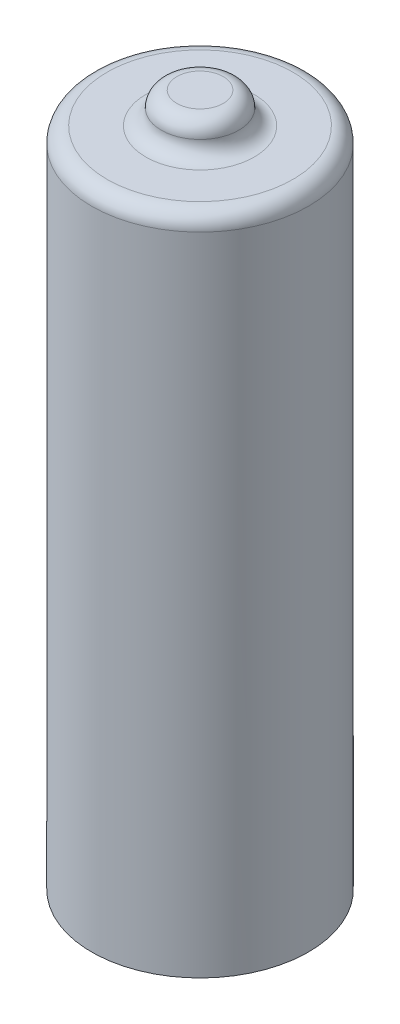
ISO-10303-21;
HEADER;
FILE_DESCRIPTION(('STEP AP214'),'2;1');
FILE_NAME('part.step','',(''),(''),'','','');
FILE_SCHEMA(('AUTOMOTIVE_DESIGN { 1 0 10303 214 1 1 1 1 }'));
ENDSEC;
DATA;
#1=APPLICATION_CONTEXT('core data for automotive mechanical design processes');
#2=APPLICATION_PROTOCOL_DEFINITION('international standard','automotive_design',2000,#1);
#3=PRODUCT_CONTEXT('',#1,'mechanical');
#4=PRODUCT('Part','Part','',(#3));
#5=PRODUCT_RELATED_PRODUCT_CATEGORY('part','',(#4));
#6=PRODUCT_DEFINITION_FORMATION('','',#4);
#7=PRODUCT_DEFINITION_CONTEXT('part definition',#1,'design');
#8=PRODUCT_DEFINITION('design','',#6,#7);
#9=PRODUCT_DEFINITION_SHAPE('','',#8);
#10=(LENGTH_UNIT() NAMED_UNIT(*) SI_UNIT(.MILLI.,.METRE.));
#11=(NAMED_UNIT(*) PLANE_ANGLE_UNIT() SI_UNIT($,.RADIAN.));
#12=(NAMED_UNIT(*) SI_UNIT($,.STERADIAN.) SOLID_ANGLE_UNIT());
#13=UNCERTAINTY_MEASURE_WITH_UNIT(LENGTH_MEASURE(1.E-05),#10,'distance_accuracy_value','');
#14=(GEOMETRIC_REPRESENTATION_CONTEXT(3) GLOBAL_UNCERTAINTY_ASSIGNED_CONTEXT((#13)) GLOBAL_UNIT_ASSIGNED_CONTEXT((#10,
#11,#12)) REPRESENTATION_CONTEXT('',''));
#15=CARTESIAN_POINT('',(0.,0.,0.));
#16=DIRECTION('',(0.,0.,1.));
#17=DIRECTION('',(1.,0.,0.));
#18=AXIS2_PLACEMENT_3D('',#15,#16,#17);
#19=CARTESIAN_POINT('',(0.,42.7,0.));
#20=DIRECTION('',(0.,-1.,0.));
#21=DIRECTION('',(0.,0.,-1.));
#22=AXIS2_PLACEMENT_3D('',#19,#20,#21);
#23=CYLINDRICAL_SURFACE('',#22,7.);
#24=CARTESIAN_POINT('',(0.,41.7,0.));
#25=DIRECTION('',(0.,1.,0.));
#26=DIRECTION('',(0.,0.,1.));
#27=AXIS2_PLACEMENT_3D('',#24,#25,#26);
#28=CIRCLE('',#27,7.);
#29=CARTESIAN_POINT('',(0.,41.7,-7.));
#30=VERTEX_POINT('',#29);
#31=EDGE_CURVE('E10',#30,#30,#28,.F.);
#32=CARTESIAN_POINT('',(0.,0.,0.));
#33=DIRECTION('',(0.,1.,0.));
#34=DIRECTION('',(0.,0.,1.));
#35=AXIS2_PLACEMENT_3D('',#32,#33,#34);
#36=CIRCLE('',#35,7.);
#37=CARTESIAN_POINT('',(0.,0.,-7.));
#38=VERTEX_POINT('',#37);
#39=EDGE_CURVE('E67',#38,#38,#36,.T.);
#40=CARTESIAN_POINT('',(0.,41.7,-7.));
#41=CARTESIAN_POINT('',(0.,41.265625,-7.));
#42=CARTESIAN_POINT('',(0.,40.83125,-7.));
#43=CARTESIAN_POINT('',(0.,39.9625,-7.));
#44=CARTESIAN_POINT('',(0.,39.528125,-7.));
#45=CARTESIAN_POINT('',(0.,38.659375,-7.));
#46=CARTESIAN_POINT('',(0.,38.225,-7.));
#47=CARTESIAN_POINT('',(0.,37.35625,-7.));
#48=CARTESIAN_POINT('',(0.,36.921875,-7.));
#49=CARTESIAN_POINT('',(0.,36.053125,-7.));
#50=CARTESIAN_POINT('',(0.,35.61875,-7.));
#51=CARTESIAN_POINT('',(0.,34.75,-7.));
#52=CARTESIAN_POINT('',(0.,34.315625,-7.));
#53=CARTESIAN_POINT('',(0.,33.446875,-7.));
#54=CARTESIAN_POINT('',(0.,33.0125,-7.));
#55=CARTESIAN_POINT('',(0.,32.14375,-7.));
#56=CARTESIAN_POINT('',(0.,31.709375,-7.));
#57=CARTESIAN_POINT('',(0.,30.840625,-7.));
#58=CARTESIAN_POINT('',(0.,30.40625,-7.));
#59=CARTESIAN_POINT('',(0.,29.5375,-7.));
#60=CARTESIAN_POINT('',(0.,29.103125,-7.));
#61=CARTESIAN_POINT('',(0.,28.234375,-7.));
#62=CARTESIAN_POINT('',(0.,27.8,-7.));
#63=CARTESIAN_POINT('',(0.,26.93125,-7.));
#64=CARTESIAN_POINT('',(0.,26.496875,-7.));
#65=CARTESIAN_POINT('',(0.,25.628125,-7.));
#66=CARTESIAN_POINT('',(0.,25.19375,-7.));
#67=CARTESIAN_POINT('',(0.,24.325,-7.));
#68=CARTESIAN_POINT('',(0.,23.890625,-7.));
#69=CARTESIAN_POINT('',(0.,23.021875,-7.));
#70=CARTESIAN_POINT('',(0.,22.5875,-7.));
#71=CARTESIAN_POINT('',(0.,21.71875,-7.));
#72=CARTESIAN_POINT('',(0.,21.284375,-7.));
#73=CARTESIAN_POINT('',(0.,20.415625,-7.));
#74=CARTESIAN_POINT('',(0.,19.98125,-7.));
#75=CARTESIAN_POINT('',(0.,19.1125,-7.));
#76=CARTESIAN_POINT('',(0.,18.678125,-7.));
#77=CARTESIAN_POINT('',(0.,17.809375,-7.));
#78=CARTESIAN_POINT('',(0.,17.375,-7.));
#79=CARTESIAN_POINT('',(0.,16.50625,-7.));
#80=CARTESIAN_POINT('',(0.,16.071875,-7.));
#81=CARTESIAN_POINT('',(0.,15.203125,-7.));
#82=CARTESIAN_POINT('',(0.,14.76875,-7.));
#83=CARTESIAN_POINT('',(0.,13.9,-7.));
#84=CARTESIAN_POINT('',(0.,13.465625,-7.));
#85=CARTESIAN_POINT('',(0.,12.596875,-7.));
#86=CARTESIAN_POINT('',(0.,12.1625,-7.));
#87=CARTESIAN_POINT('',(0.,11.29375,-7.));
#88=CARTESIAN_POINT('',(0.,10.859375,-7.));
#89=CARTESIAN_POINT('',(0.,9.990625,-7.));
#90=CARTESIAN_POINT('',(0.,9.55625,-7.));
#91=CARTESIAN_POINT('',(0.,8.68749999999999,-7.));
#92=CARTESIAN_POINT('',(0.,8.25312499999999,-7.));
#93=CARTESIAN_POINT('',(0.,7.38437499999999,-7.));
#94=CARTESIAN_POINT('',(0.,6.94999999999999,-7.));
#95=CARTESIAN_POINT('',(0.,6.08125,-7.));
#96=CARTESIAN_POINT('',(0.,5.646875,-7.));
#97=CARTESIAN_POINT('',(0.,4.77812499999999,-7.));
#98=CARTESIAN_POINT('',(0.,4.34374999999999,-7.));
#99=CARTESIAN_POINT('',(0.,3.47499999999999,-7.));
#100=CARTESIAN_POINT('',(0.,3.04062499999999,-7.));
#101=CARTESIAN_POINT('',(0.,2.17187499999999,-7.));
#102=CARTESIAN_POINT('',(0.,1.73749999999999,-7.));
#103=CARTESIAN_POINT('',(0.,0.868749999999995,-7.));
#104=CARTESIAN_POINT('',(0.,0.434374999999994,-7.));
#105=CARTESIAN_POINT('',(0.,0.,-7.));
#106=B_SPLINE_CURVE_WITH_KNOTS('',3,(#40,#41,#42,#43,#44,#45,#46,#47,#48,#49,#50,#51,#52,#53,
#54,#55,#56,#57,#58,#59,#60,#61,#62,#63,#64,#65,#66,#67,#68,#69,#70,#71,#72,#73,#74,#75,#76,#77,
#78,#79,#80,#81,#82,#83,#84,#85,#86,#87,#88,#89,#90,#91,#92,#93,#94,#95,#96,#97,#98,#99,#100,
#101,#102,#103,#104,#105),.UNSPECIFIED.,.F.,.F.,(4,2,2,2,2,2,2,2,2,2,2,2,2,2,2,2,2,2,2,2,2,2,2,
2,2,2,2,2,2,2,2,2,4),(0.,1.303125,2.60625,3.909375,5.2125,6.515625,7.81874999999999,
9.12187499999999,10.425,11.728125,13.03125,14.334375,15.6375,16.940625,18.24375,19.546875,20.85,
22.153125,23.45625,24.759375,26.0625,27.365625,28.66875,29.971875,31.275,32.578125,33.88125,
35.184375,36.4875,37.790625,39.09375,40.396875,41.7),.UNSPECIFIED.);
#107=EDGE_CURVE('BSEAM39',#30,#38,#106,.T.);
#108=ORIENTED_EDGE('',*,*,#31,.T.);
#109=ORIENTED_EDGE('',*,*,#39,.T.);
#110=ORIENTED_EDGE('',*,*,#107,.T.);
#111=ORIENTED_EDGE('',*,*,#107,.F.);
#112=EDGE_LOOP('',(#108,#110,#109,#111));
#113=FACE_BOUND('',#112,.T.);
#114=ADVANCED_FACE('F39',(#113),#23,.T.);
#115=CARTESIAN_POINT('',(0.,42.7,0.));
#116=DIRECTION('',(0.,1.,0.));
#117=DIRECTION('',(0.,0.,1.));
#118=AXIS2_PLACEMENT_3D('',#115,#116,#117);
#119=PLANE('',#118);
#120=CARTESIAN_POINT('',(0.,42.7,0.));
#121=DIRECTION('',(0.,1.,0.));
#122=DIRECTION('',(0.,0.,1.));
#123=AXIS2_PLACEMENT_3D('',#120,#121,#122);
#124=CIRCLE('',#123,3.5);
#125=CARTESIAN_POINT('',(0.,42.7,3.5));
#126=VERTEX_POINT('',#125);
#127=EDGE_CURVE('E48',#126,#126,#124,.F.);
#128=ORIENTED_EDGE('',*,*,#127,.T.);
#129=EDGE_LOOP('',(#128));
#130=FACE_BOUND('',#129,.T.);
#131=CARTESIAN_POINT('',(0.,42.7,0.));
#132=DIRECTION('',(0.,1.,0.));
#133=DIRECTION('',(0.,0.,1.));
#134=AXIS2_PLACEMENT_3D('',#131,#132,#133);
#135=CIRCLE('',#134,6.);
#136=CARTESIAN_POINT('',(0.,42.7,6.));
#137=VERTEX_POINT('',#136);
#138=EDGE_CURVE('E53',#137,#137,#135,.T.);
#139=ORIENTED_EDGE('',*,*,#138,.T.);
#140=EDGE_LOOP('',(#139));
#141=FACE_BOUND('',#140,.T.);
#142=ADVANCED_FACE('F105',(#130,#141),#119,.T.);
#143=CARTESIAN_POINT('',(0.,0.,0.));
#144=DIRECTION('',(0.,1.,0.));
#145=DIRECTION('',(0.,0.,1.));
#146=AXIS2_PLACEMENT_3D('',#143,#144,#145);
#147=PLANE('',#146);
#148=CARTESIAN_POINT('',(0.,0.,0.));
#149=DIRECTION('',(0.,-1.,0.));
#150=DIRECTION('',(0.,0.,-1.));
#151=AXIS2_PLACEMENT_3D('',#148,#149,#150);
#152=CIRCLE('',#151,6.);
#153=CARTESIAN_POINT('',(0.,0.,-6.));
#154=VERTEX_POINT('',#153);
#155=EDGE_CURVE('E72',#154,#154,#152,.T.);
#156=ORIENTED_EDGE('',*,*,#155,.F.);
#157=EDGE_LOOP('',(#156));
#158=FACE_BOUND('',#157,.T.);
#159=ORIENTED_EDGE('',*,*,#39,.F.);
#160=EDGE_LOOP('',(#159));
#161=FACE_BOUND('',#160,.T.);
#162=ADVANCED_FACE('F110',(#158,#161),#147,.F.);
#163=CARTESIAN_POINT('',(0.,1.,0.));
#164=DIRECTION('',(0.,-1.,0.));
#165=DIRECTION('',(0.,0.,-1.));
#166=AXIS2_PLACEMENT_3D('',#163,#164,#165);
#167=CYLINDRICAL_SURFACE('',#166,6.);
#168=CARTESIAN_POINT('',(0.,1.,0.));
#169=DIRECTION('',(0.,-1.,0.));
#170=DIRECTION('',(0.,0.,-1.));
#171=AXIS2_PLACEMENT_3D('',#168,#169,#170);
#172=CIRCLE('',#171,6.);
#173=CARTESIAN_POINT('',(0.,1.,-6.));
#174=VERTEX_POINT('',#173);
#175=EDGE_CURVE('E71',#174,#174,#172,.T.);
#176=ORIENTED_EDGE('',*,*,#175,.F.);
#177=EDGE_LOOP('',(#176));
#178=FACE_BOUND('',#177,.T.);
#179=ORIENTED_EDGE('',*,*,#155,.T.);
#180=EDGE_LOOP('',(#179));
#181=FACE_BOUND('',#180,.T.);
#182=ADVANCED_FACE('F116',(#178,#181),#167,.F.);
#183=CARTESIAN_POINT('',(0.,1.,0.));
#184=DIRECTION('',(0.,-1.,0.));
#185=DIRECTION('',(0.,0.,-1.));
#186=AXIS2_PLACEMENT_3D('',#183,#184,#185);
#187=PLANE('',#186);
#188=CARTESIAN_POINT('',(0.,1.,0.));
#189=DIRECTION('',(0.,-1.,0.));
#190=DIRECTION('',(0.,0.,-1.));
#191=AXIS2_PLACEMENT_3D('',#188,#189,#190);
#192=CIRCLE('',#191,3.5);
#193=CARTESIAN_POINT('',(0.,1.,-3.5));
#194=VERTEX_POINT('',#193);
#195=EDGE_CURVE('E63',#194,#194,#192,.F.);
#196=ORIENTED_EDGE('',*,*,#195,.T.);
#197=EDGE_LOOP('',(#196));
#198=FACE_BOUND('',#197,.T.);
#199=ORIENTED_EDGE('',*,*,#175,.T.);
#200=EDGE_LOOP('',(#199));
#201=FACE_BOUND('',#200,.T.);
#202=ADVANCED_FACE('F121',(#198,#201),#187,.T.);
#203=CARTESIAN_POINT('',(0.,0.,0.));
#204=DIRECTION('',(0.,1.,0.));
#205=DIRECTION('',(0.,0.,1.));
#206=AXIS2_PLACEMENT_3D('',#203,#204,#205);
#207=PLANE('',#206);
#208=CARTESIAN_POINT('',(0.,0.,0.));
#209=DIRECTION('',(0.,1.,0.));
#210=DIRECTION('',(0.,0.,1.));
#211=AXIS2_PLACEMENT_3D('',#208,#209,#210);
#212=CIRCLE('',#211,2.5);
#213=CARTESIAN_POINT('',(0.,0.,2.5));
#214=VERTEX_POINT('',#213);
#215=EDGE_CURVE('E76',#214,#214,#212,.F.);
#216=ORIENTED_EDGE('',*,*,#215,.T.);
#217=EDGE_LOOP('',(#216));
#218=FACE_BOUND('',#217,.T.);
#219=ADVANCED_FACE('F125',(#218),#207,.F.);
#220=CARTESIAN_POINT('',(0.,44.7,0.));
#221=DIRECTION('',(0.,1.,0.));
#222=DIRECTION('',(0.,0.,1.));
#223=AXIS2_PLACEMENT_3D('',#220,#221,#222);
#224=PLANE('',#223);
#225=CARTESIAN_POINT('',(0.,44.7,0.));
#226=DIRECTION('',(0.,1.,0.));
#227=DIRECTION('',(0.,0.,1.));
#228=AXIS2_PLACEMENT_3D('',#225,#226,#227);
#229=CIRCLE('',#228,1.5);
#230=CARTESIAN_POINT('',(0.,44.7,1.5));
#231=VERTEX_POINT('',#230);
#232=EDGE_CURVE('E59',#231,#231,#229,.T.);
#233=ORIENTED_EDGE('',*,*,#232,.T.);
#234=EDGE_LOOP('',(#233));
#235=FACE_BOUND('',#234,.T.);
#236=ADVANCED_FACE('F100',(#235),#224,.T.);
#237=CARTESIAN_POINT('',(0.,0.,0.));
#238=DIRECTION('',(0.,-1.,0.));
#239=DIRECTION('',(0.,0.,-1.));
#240=AXIS2_PLACEMENT_3D('',#237,#238,#239);
#241=TOROIDAL_SURFACE('',#240,3.5,1.);
#242=ORIENTED_EDGE('',*,*,#195,.F.);
#243=EDGE_LOOP('',(#242));
#244=FACE_BOUND('',#243,.T.);
#245=ORIENTED_EDGE('',*,*,#215,.F.);
#246=EDGE_LOOP('',(#245));
#247=FACE_BOUND('',#246,.T.);
#248=ADVANCED_FACE('F93',(#244,#247),#241,.F.);
#249=CARTESIAN_POINT('',(0.,43.7,0.));
#250=DIRECTION('',(0.,1.,0.));
#251=DIRECTION('',(0.,0.,1.));
#252=AXIS2_PLACEMENT_3D('',#249,#250,#251);
#253=TOROIDAL_SURFACE('',#252,3.5,1.);
#254=ORIENTED_EDGE('',*,*,#127,.F.);
#255=EDGE_LOOP('',(#254));
#256=FACE_BOUND('',#255,.T.);
#257=CARTESIAN_POINT('',(0.,43.7,0.));
#258=DIRECTION('',(0.,1.,0.));
#259=DIRECTION('',(0.,0.,1.));
#260=AXIS2_PLACEMENT_3D('',#257,#258,#259);
#261=CIRCLE('',#260,2.5);
#262=CARTESIAN_POINT('',(0.,43.7,2.5));
#263=VERTEX_POINT('',#262);
#264=EDGE_CURVE('E43',#263,#263,#261,.T.);
#265=ORIENTED_EDGE('',*,*,#264,.F.);
#266=EDGE_LOOP('',(#265));
#267=FACE_BOUND('',#266,.T.);
#268=ADVANCED_FACE('F91',(#256,#267),#253,.F.);
#269=CARTESIAN_POINT('',(0.,43.7,0.));
#270=DIRECTION('',(0.,1.,0.));
#271=DIRECTION('',(0.,0.,1.));
#272=AXIS2_PLACEMENT_3D('',#269,#270,#271);
#273=TOROIDAL_SURFACE('',#272,1.5,1.);
#274=ORIENTED_EDGE('',*,*,#264,.T.);
#275=EDGE_LOOP('',(#274));
#276=FACE_BOUND('',#275,.T.);
#277=ORIENTED_EDGE('',*,*,#232,.F.);
#278=EDGE_LOOP('',(#277));
#279=FACE_BOUND('',#278,.T.);
#280=ADVANCED_FACE('F88',(#276,#279),#273,.T.);
#281=CARTESIAN_POINT('',(0.,41.7,0.));
#282=DIRECTION('',(0.,1.,0.));
#283=DIRECTION('',(0.,0.,1.));
#284=AXIS2_PLACEMENT_3D('',#281,#282,#283);
#285=TOROIDAL_SURFACE('',#284,6.,1.);
#286=ORIENTED_EDGE('',*,*,#31,.F.);
#287=EDGE_LOOP('',(#286));
#288=FACE_BOUND('',#287,.T.);
#289=ORIENTED_EDGE('',*,*,#138,.F.);
#290=EDGE_LOOP('',(#289));
#291=FACE_BOUND('',#290,.T.);
#292=ADVANCED_FACE('F41',(#288,#291),#285,.T.);
#293=CLOSED_SHELL('',(#114,#142,#162,#182,#202,#219,#236,#248,#268,#280,#292));
#294=MANIFOLD_SOLID_BREP('B2',#293);
#295=ADVANCED_BREP_SHAPE_REPRESENTATION('',(#18,#294),#14);
#296=SHAPE_DEFINITION_REPRESENTATION(#9,#295);
ENDSEC;
END-ISO-10303-21;
